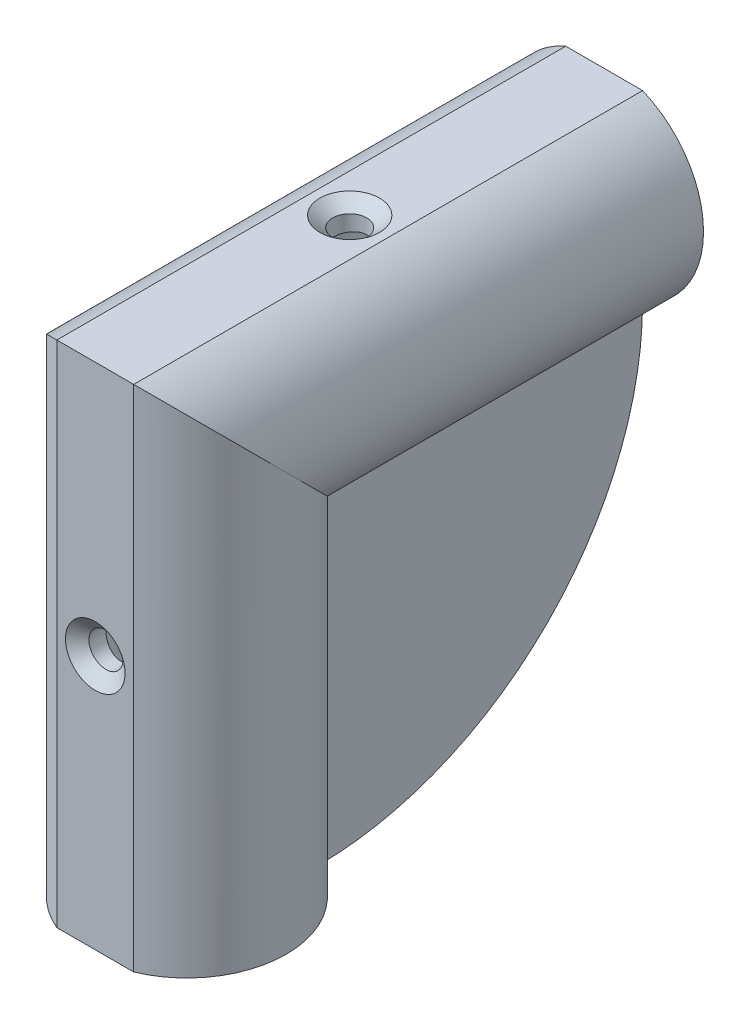
ISO-10303-21;
HEADER;
FILE_DESCRIPTION(('STEP AP214'),'2;1');
FILE_NAME('part.step','',(''),(''),'','','');
FILE_SCHEMA(('AUTOMOTIVE_DESIGN { 1 0 10303 214 1 1 1 1 }'));
ENDSEC;
DATA;
#1=APPLICATION_CONTEXT('core data for automotive mechanical design processes');
#2=APPLICATION_PROTOCOL_DEFINITION('international standard','automotive_design',2000,#1);
#3=PRODUCT_CONTEXT('',#1,'mechanical');
#4=PRODUCT('Part','Part','',(#3));
#5=PRODUCT_RELATED_PRODUCT_CATEGORY('part','',(#4));
#6=PRODUCT_DEFINITION_FORMATION('','',#4);
#7=PRODUCT_DEFINITION_CONTEXT('part definition',#1,'design');
#8=PRODUCT_DEFINITION('design','',#6,#7);
#9=PRODUCT_DEFINITION_SHAPE('','',#8);
#10=(LENGTH_UNIT() NAMED_UNIT(*) SI_UNIT(.MILLI.,.METRE.));
#11=(NAMED_UNIT(*) PLANE_ANGLE_UNIT() SI_UNIT($,.RADIAN.));
#12=(NAMED_UNIT(*) SI_UNIT($,.STERADIAN.) SOLID_ANGLE_UNIT());
#13=UNCERTAINTY_MEASURE_WITH_UNIT(LENGTH_MEASURE(1.E-05),#10,'distance_accuracy_value','');
#14=(GEOMETRIC_REPRESENTATION_CONTEXT(3) GLOBAL_UNCERTAINTY_ASSIGNED_CONTEXT((#13)) GLOBAL_UNIT_ASSIGNED_CONTEXT((#10,
#11,#12)) REPRESENTATION_CONTEXT('',''));
#15=CARTESIAN_POINT('',(0.,0.,0.));
#16=DIRECTION('',(0.,0.,1.));
#17=DIRECTION('',(1.,0.,0.));
#18=AXIS2_PLACEMENT_3D('',#15,#16,#17);
#19=CARTESIAN_POINT('',(-0.509990204288252,0.,0.));
#20=DIRECTION('',(1.,0.,0.));
#21=DIRECTION('',(0.,0.,-1.));
#22=AXIS2_PLACEMENT_3D('',#19,#20,#21);
#23=PLANE('',#22);
#24=CARTESIAN_POINT('',(-0.509990204288252,21.9038973614066,-27.511452395118));
#25=DIRECTION('',(1.,0.,0.));
#26=DIRECTION('',(0.,0.,-1.));
#27=AXIS2_PLACEMENT_3D('',#24,#25,#26);
#28=CIRCLE('',#27,1.63194999999999);
#29=CARTESIAN_POINT('',(-0.509990204288252,21.9038973614066,-29.143402395118));
#30=VERTEX_POINT('',#29);
#31=EDGE_CURVE('E229',#30,#30,#28,.T.);
#32=ORIENTED_EDGE('',*,*,#31,.F.);
#33=EDGE_LOOP('',(#32));
#34=FACE_BOUND('',#33,.T.);
#35=CARTESIAN_POINT('',(-0.509990204288252,12.488547604882,-18.0961026385934));
#36=DIRECTION('',(1.,0.,0.));
#37=DIRECTION('',(0.,0.,-1.));
#38=AXIS2_PLACEMENT_3D('',#35,#36,#37);
#39=CIRCLE('',#38,1.63194999999999);
#40=CARTESIAN_POINT('',(-0.509990204288252,12.488547604882,-19.7280526385934));
#41=VERTEX_POINT('',#40);
#42=EDGE_CURVE('E135',#41,#41,#39,.T.);
#43=ORIENTED_EDGE('',*,*,#42,.F.);
#44=EDGE_LOOP('',(#43));
#45=FACE_BOUND('',#44,.T.);
#46=DIRECTION('',(0.,0.,-1.));
#47=VECTOR('',#46,1.);
#48=CARTESIAN_POINT('',(-0.509990204288252,28.0165862273054,-11.9834137726946));
#49=LINE('',#48,#47);
#50=CARTESIAN_POINT('',(-0.509990204288252,28.0165862273054,-11.9834137726946));
#51=VERTEX_POINT('',#50);
#52=CARTESIAN_POINT('',(-0.509990204288252,28.0165862273054,-39.8355514718417));
#53=VERTEX_POINT('',#52);
#54=EDGE_CURVE('E51',#51,#53,#49,.T.);
#55=ORIENTED_EDGE('',*,*,#54,.F.);
#56=DIRECTION('',(0.,1.,0.));
#57=VECTOR('',#56,1.);
#58=CARTESIAN_POINT('',(-0.509990204288252,28.0165862273054,-11.9834137726946));
#59=LINE('',#58,#57);
#60=CARTESIAN_POINT('',(-0.509990204288252,0.164448528158289,-11.9834137726946));
#61=VERTEX_POINT('',#60);
#62=EDGE_CURVE('E138',#61,#51,#59,.T.);
#63=ORIENTED_EDGE('',*,*,#62,.F.);
#64=CARTESIAN_POINT('',(-0.509990204288252,31.2165862273054,-8.78341377269464));
#65=DIRECTION('',(1.,0.,0.));
#66=DIRECTION('',(0.,0.,-1.));
#67=AXIS2_PLACEMENT_3D('',#64,#65,#66);
#68=CIRCLE('',#67,31.2165862273054);
#69=EDGE_CURVE('E55',#61,#53,#68,.T.);
#70=ORIENTED_EDGE('',*,*,#69,.T.);
#71=EDGE_LOOP('',(#55,#63,#70));
#72=FACE_BOUND('',#71,.T.);
#73=ADVANCED_FACE('F34',(#34,#45,#72),#23,.T.);
#74=CARTESIAN_POINT('',(0.,40.,9.76175514996408));
#75=DIRECTION('',(0.,0.,-1.));
#76=DIRECTION('',(-1.,0.,0.));
#77=AXIS2_PLACEMENT_3D('',#74,#75,#76);
#78=CYLINDRICAL_SURFACE('',#77,9.52509896578834);
#79=CARTESIAN_POINT('',(0.,40.,0.));
#80=DIRECTION('',(0.,0.707106781186547,-0.707106781186547));
#81=DIRECTION('',(0.,0.707106781186548,0.707106781186548));
#82=AXIS2_PLACEMENT_3D('',#79,#80,#81);
#83=ELLIPSE('',#82,13.4705241403638,9.52509896578834);
#84=CARTESIAN_POINT('',(-3.68499020428826,48.7834137726946,8.78341377269463));
#85=VERTEX_POINT('',#84);
#86=CARTESIAN_POINT('',(-3.68499020428825,31.2165862273054,-8.78341377269464));
#87=VERTEX_POINT('',#86);
#88=EDGE_CURVE('E264',#85,#87,#83,.F.);
#89=ORIENTED_EDGE('',*,*,#88,.F.);
#90=DIRECTION('',(0.,0.,-1.));
#91=VECTOR('',#90,1.);
#92=CARTESIAN_POINT('',(-3.68499020428826,48.7834137726946,9.76175514996408));
#93=LINE('',#92,#91);
#94=CARTESIAN_POINT('',(-3.68499020428826,48.7834137726946,-40.));
#95=VERTEX_POINT('',#94);
#96=EDGE_CURVE('E256',#85,#95,#93,.T.);
#97=ORIENTED_EDGE('',*,*,#96,.T.);
#98=CARTESIAN_POINT('',(0.,40.,-40.));
#99=DIRECTION('',(0.,0.,-1.));
#100=DIRECTION('',(0.,1.,0.));
#101=AXIS2_PLACEMENT_3D('',#98,#99,#100);
#102=CIRCLE('',#101,9.52509896578834);
#103=CARTESIAN_POINT('',(-3.68499020428825,31.2165862273054,-40.));
#104=VERTEX_POINT('',#103);
#105=EDGE_CURVE('E277',#104,#95,#102,.T.);
#106=ORIENTED_EDGE('',*,*,#105,.F.);
#107=DIRECTION('',(0.,0.,-1.));
#108=VECTOR('',#107,1.);
#109=CARTESIAN_POINT('',(-3.68499020428825,31.2165862273054,9.76175514996408));
#110=LINE('',#109,#108);
#111=EDGE_CURVE('E38',#87,#104,#110,.T.);
#112=ORIENTED_EDGE('',*,*,#111,.F.);
#113=EDGE_LOOP('',(#89,#97,#106,#112));
#114=FACE_BOUND('',#113,.T.);
#115=ADVANCED_FACE('F189',(#114),#78,.T.);
#116=CARTESIAN_POINT('',(-3.68499020428826,48.7834137726946,9.76175514996408));
#117=DIRECTION('',(0.,1.,0.));
#118=DIRECTION('',(0.,0.,1.));
#119=AXIS2_PLACEMENT_3D('',#116,#117,#118);
#120=PLANE('',#119);
#121=CARTESIAN_POINT('',(-0.00012790899028611,48.7834137726946,-15.6082931136527));
#122=DIRECTION('',(0.,1.,0.));
#123=DIRECTION('',(0.,0.,1.));
#124=AXIS2_PLACEMENT_3D('',#121,#122,#123);
#125=CIRCLE('',#124,2.8575);
#126=CARTESIAN_POINT('',(-0.00012790899028611,48.7834137726946,-12.7507931136527));
#127=VERTEX_POINT('',#126);
#128=EDGE_CURVE('E166',#127,#127,#125,.T.);
#129=ORIENTED_EDGE('',*,*,#128,.F.);
#130=EDGE_LOOP('',(#129));
#131=FACE_BOUND('',#130,.T.);
#132=DIRECTION('',(-1.,0.,0.));
#133=VECTOR('',#132,1.);
#134=CARTESIAN_POINT('',(-3.68499020428826,48.7834137726946,8.78341377269463));
#135=LINE('',#134,#133);
#136=CARTESIAN_POINT('',(3.68473438630768,48.7834137726946,8.78341377269463));
#137=VERTEX_POINT('',#136);
#138=EDGE_CURVE('E287',#137,#85,#135,.T.);
#139=ORIENTED_EDGE('',*,*,#138,.F.);
#140=DIRECTION('',(0.,0.,-1.));
#141=VECTOR('',#140,1.);
#142=CARTESIAN_POINT('',(3.68473438630768,48.7834137726946,9.76175514996408));
#143=LINE('',#142,#141);
#144=CARTESIAN_POINT('',(3.68473438630768,48.7834137726946,-40.));
#145=VERTEX_POINT('',#144);
#146=EDGE_CURVE('E269',#137,#145,#143,.T.);
#147=ORIENTED_EDGE('',*,*,#146,.T.);
#148=DIRECTION('',(1.,0.,0.));
#149=VECTOR('',#148,1.);
#150=CARTESIAN_POINT('',(-3.68499020428826,48.7834137726946,-40.));
#151=LINE('',#150,#149);
#152=EDGE_CURVE('E284',#95,#145,#151,.T.);
#153=ORIENTED_EDGE('',*,*,#152,.F.);
#154=ORIENTED_EDGE('',*,*,#96,.F.);
#155=EDGE_LOOP('',(#139,#147,#153,#154));
#156=FACE_BOUND('',#155,.T.);
#157=ADVANCED_FACE('F338',(#131,#156),#120,.T.);
#158=CARTESIAN_POINT('',(0.,40.,9.76175514996408));
#159=DIRECTION('',(0.,0.,-1.));
#160=DIRECTION('',(-1.,0.,0.));
#161=AXIS2_PLACEMENT_3D('',#158,#159,#160);
#162=CYLINDRICAL_SURFACE('',#161,9.525);
#163=CARTESIAN_POINT('',(0.,40.,0.));
#164=DIRECTION('',(0.,0.707106781186547,-0.707106781186547));
#165=DIRECTION('',(0.,0.707106781186548,0.707106781186548));
#166=AXIS2_PLACEMENT_3D('',#163,#164,#165);
#167=ELLIPSE('',#166,13.4703841816037,9.525);
#168=CARTESIAN_POINT('',(3.68473438630768,31.2165862273054,-8.78341377269464));
#169=VERTEX_POINT('',#168);
#170=EDGE_CURVE('E266',#169,#137,#167,.F.);
#171=ORIENTED_EDGE('',*,*,#170,.F.);
#172=DIRECTION('',(0.,0.,-1.));
#173=VECTOR('',#172,1.);
#174=CARTESIAN_POINT('',(3.68473438630768,31.2165862273054,9.76175514996408));
#175=LINE('',#174,#173);
#176=CARTESIAN_POINT('',(3.68473438630768,31.2165862273054,-40.));
#177=VERTEX_POINT('',#176);
#178=EDGE_CURVE('E267',#169,#177,#175,.T.);
#179=ORIENTED_EDGE('',*,*,#178,.T.);
#180=CARTESIAN_POINT('',(0.,40.,-40.));
#181=DIRECTION('',(0.,0.,-1.));
#182=DIRECTION('',(0.,1.,0.));
#183=AXIS2_PLACEMENT_3D('',#180,#181,#182);
#184=CIRCLE('',#183,9.525);
#185=EDGE_CURVE('E289',#145,#177,#184,.T.);
#186=ORIENTED_EDGE('',*,*,#185,.F.);
#187=ORIENTED_EDGE('',*,*,#146,.F.);
#188=EDGE_LOOP('',(#171,#179,#186,#187));
#189=FACE_BOUND('',#188,.T.);
#190=ADVANCED_FACE('F36',(#189),#162,.T.);
#191=CARTESIAN_POINT('',(0.,0.,0.));
#192=DIRECTION('',(0.,1.,0.));
#193=DIRECTION('',(0.,0.,1.));
#194=AXIS2_PLACEMENT_3D('',#191,#192,#193);
#195=CYLINDRICAL_SURFACE('',#194,9.525);
#196=DIRECTION('',(0.,1.,0.));
#197=VECTOR('',#196,1.);
#198=CARTESIAN_POINT('',(3.68473438630768,0.,-8.78341377269463));
#199=LINE('',#198,#197);
#200=CARTESIAN_POINT('',(3.68473438630768,0.,-8.78341377269463));
#201=VERTEX_POINT('',#200);
#202=EDGE_CURVE('E261',#201,#169,#199,.T.);
#203=ORIENTED_EDGE('',*,*,#202,.T.);
#204=ORIENTED_EDGE('',*,*,#170,.T.);
#205=DIRECTION('',(0.,1.,0.));
#206=VECTOR('',#205,1.);
#207=CARTESIAN_POINT('',(3.68473438630768,0.,8.78341377269463));
#208=LINE('',#207,#206);
#209=CARTESIAN_POINT('',(3.68473438630768,0.,8.78341377269463));
#210=VERTEX_POINT('',#209);
#211=EDGE_CURVE('E254',#210,#137,#208,.T.);
#212=ORIENTED_EDGE('',*,*,#211,.F.);
#213=CARTESIAN_POINT('',(0.,0.,0.));
#214=DIRECTION('',(0.,1.,0.));
#215=DIRECTION('',(0.,0.,1.));
#216=AXIS2_PLACEMENT_3D('',#213,#214,#215);
#217=CIRCLE('',#216,9.525);
#218=EDGE_CURVE('E311',#210,#201,#217,.T.);
#219=ORIENTED_EDGE('',*,*,#218,.T.);
#220=EDGE_LOOP('',(#203,#204,#212,#219));
#221=FACE_BOUND('',#220,.T.);
#222=ADVANCED_FACE('F298',(#221),#195,.T.);
#223=CARTESIAN_POINT('',(-3.68499020428826,0.,8.78341377269463));
#224=DIRECTION('',(0.,0.,1.));
#225=DIRECTION('',(1.,0.,0.));
#226=AXIS2_PLACEMENT_3D('',#223,#224,#225);
#227=PLANE('',#226);
#228=CARTESIAN_POINT('',(-6.39544951406514E-05,24.3917068863473,8.78341377269463));
#229=DIRECTION('',(0.,0.,1.));
#230=DIRECTION('',(1.,0.,0.));
#231=AXIS2_PLACEMENT_3D('',#228,#229,#230);
#232=CIRCLE('',#231,2.8575);
#233=CARTESIAN_POINT('',(2.85743604550486,24.3917068863473,8.78341377269463));
#234=VERTEX_POINT('',#233);
#235=EDGE_CURVE('E151',#234,#234,#232,.T.);
#236=ORIENTED_EDGE('',*,*,#235,.F.);
#237=EDGE_LOOP('',(#236));
#238=FACE_BOUND('',#237,.T.);
#239=ORIENTED_EDGE('',*,*,#211,.T.);
#240=ORIENTED_EDGE('',*,*,#138,.T.);
#241=DIRECTION('',(0.,1.,0.));
#242=VECTOR('',#241,1.);
#243=CARTESIAN_POINT('',(-3.68499020428826,0.,8.78341377269463));
#244=LINE('',#243,#242);
#245=CARTESIAN_POINT('',(-3.68499020428826,0.,8.78341377269463));
#246=VERTEX_POINT('',#245);
#247=EDGE_CURVE('E251',#246,#85,#244,.T.);
#248=ORIENTED_EDGE('',*,*,#247,.F.);
#249=DIRECTION('',(1.,0.,0.));
#250=VECTOR('',#249,1.);
#251=CARTESIAN_POINT('',(-3.68499020428826,0.,8.78341377269463));
#252=LINE('',#251,#250);
#253=EDGE_CURVE('E308',#246,#210,#252,.T.);
#254=ORIENTED_EDGE('',*,*,#253,.T.);
#255=EDGE_LOOP('',(#239,#240,#248,#254));
#256=FACE_BOUND('',#255,.T.);
#257=ADVANCED_FACE('F305',(#238,#256),#227,.T.);
#258=CARTESIAN_POINT('',(0.,0.,0.));
#259=DIRECTION('',(0.,1.,0.));
#260=DIRECTION('',(0.,0.,1.));
#261=AXIS2_PLACEMENT_3D('',#258,#259,#260);
#262=CYLINDRICAL_SURFACE('',#261,9.52509896578834);
#263=ORIENTED_EDGE('',*,*,#247,.T.);
#264=ORIENTED_EDGE('',*,*,#88,.T.);
#265=DIRECTION('',(0.,1.,0.));
#266=VECTOR('',#265,1.);
#267=CARTESIAN_POINT('',(-3.68499020428825,0.,-8.78341377269463));
#268=LINE('',#267,#266);
#269=CARTESIAN_POINT('',(-3.68499020428825,0.,-8.78341377269463));
#270=VERTEX_POINT('',#269);
#271=EDGE_CURVE('E248',#270,#87,#268,.T.);
#272=ORIENTED_EDGE('',*,*,#271,.F.);
#273=CARTESIAN_POINT('',(0.,0.,0.));
#274=DIRECTION('',(0.,1.,0.));
#275=DIRECTION('',(0.,0.,1.));
#276=AXIS2_PLACEMENT_3D('',#273,#274,#275);
#277=CIRCLE('',#276,9.52509896578834);
#278=EDGE_CURVE('E294',#270,#246,#277,.T.);
#279=ORIENTED_EDGE('',*,*,#278,.T.);
#280=EDGE_LOOP('',(#263,#264,#272,#279));
#281=FACE_BOUND('',#280,.T.);
#282=ADVANCED_FACE('F322',(#281),#262,.T.);
#283=CARTESIAN_POINT('',(0.,40.,-40.));
#284=DIRECTION('',(0.,0.,-1.));
#285=DIRECTION('',(0.,1.,0.));
#286=AXIS2_PLACEMENT_3D('',#283,#284,#285);
#287=PLANE('',#286);
#288=CARTESIAN_POINT('',(0.,40.,-40.));
#289=DIRECTION('',(0.,0.,-1.));
#290=DIRECTION('',(0.,1.,0.));
#291=AXIS2_PLACEMENT_3D('',#288,#289,#290);
#292=CIRCLE('',#291,6.35);
#293=CARTESIAN_POINT('',(0.,46.35,-40.));
#294=VERTEX_POINT('',#293);
#295=EDGE_CURVE('E318',#294,#294,#292,.F.);
#296=ORIENTED_EDGE('',*,*,#295,.T.);
#297=EDGE_LOOP('',(#296));
#298=FACE_BOUND('',#297,.T.);
#299=ORIENTED_EDGE('',*,*,#105,.T.);
#300=ORIENTED_EDGE('',*,*,#152,.T.);
#301=ORIENTED_EDGE('',*,*,#185,.T.);
#302=DIRECTION('',(-1.,0.,0.));
#303=VECTOR('',#302,1.);
#304=CARTESIAN_POINT('',(-3.68499020428825,31.2165862273054,-40.));
#305=LINE('',#304,#303);
#306=EDGE_CURVE('E286',#177,#104,#305,.T.);
#307=ORIENTED_EDGE('',*,*,#306,.T.);
#308=EDGE_LOOP('',(#299,#300,#301,#307));
#309=FACE_BOUND('',#308,.T.);
#310=ADVANCED_FACE('F282',(#298,#309),#287,.T.);
#311=CARTESIAN_POINT('',(0.,0.,0.));
#312=DIRECTION('',(0.,1.,0.));
#313=DIRECTION('',(0.,0.,1.));
#314=AXIS2_PLACEMENT_3D('',#311,#312,#313);
#315=PLANE('',#314);
#316=CARTESIAN_POINT('',(0.,0.,0.));
#317=DIRECTION('',(0.,1.,0.));
#318=DIRECTION('',(0.,0.,1.));
#319=AXIS2_PLACEMENT_3D('',#316,#317,#318);
#320=CIRCLE('',#319,6.35);
#321=CARTESIAN_POINT('',(0.,0.,6.35));
#322=VERTEX_POINT('',#321);
#323=EDGE_CURVE('E43',#322,#322,#320,.F.);
#324=ORIENTED_EDGE('',*,*,#323,.F.);
#325=EDGE_LOOP('',(#324));
#326=FACE_BOUND('',#325,.T.);
#327=ORIENTED_EDGE('',*,*,#278,.F.);
#328=DIRECTION('',(-1.,0.,0.));
#329=VECTOR('',#328,1.);
#330=CARTESIAN_POINT('',(-3.68499020428825,0.,-8.78341377269463));
#331=LINE('',#330,#329);
#332=EDGE_CURVE('E313',#201,#270,#331,.T.);
#333=ORIENTED_EDGE('',*,*,#332,.F.);
#334=ORIENTED_EDGE('',*,*,#218,.F.);
#335=ORIENTED_EDGE('',*,*,#253,.F.);
#336=EDGE_LOOP('',(#327,#333,#334,#335));
#337=FACE_BOUND('',#336,.T.);
#338=ADVANCED_FACE('F321',(#326,#337),#315,.F.);
#339=CARTESIAN_POINT('',(0.,40.,7.08499999999999));
#340=DIRECTION('',(0.,0.,-1.));
#341=DIRECTION('',(-1.,0.,0.));
#342=AXIS2_PLACEMENT_3D('',#339,#340,#341);
#343=CYLINDRICAL_SURFACE('',#342,6.35);
#344=CARTESIAN_POINT('',(-0.00012790899028611,46.3499999987118,-13.9763431136527));
#345=CARTESIAN_POINT('',(-0.0902114292119154,46.349996721458,-13.9763454874293));
#346=CARTESIAN_POINT('',(-0.18032096494862,46.3480604276424,-13.9838270780855));
#347=CARTESIAN_POINT('',(-0.357951930781546,46.3405274490904,-14.0135075526206));
#348=CARTESIAN_POINT('',(-0.445471959614586,46.33492881909,-14.0357142578868));
#349=CARTESIAN_POINT('',(-0.615333574694803,46.3206901550401,-14.0940811567383));
#350=CARTESIAN_POINT('',(-0.697681424375359,46.3120538866147,-14.1302240795351));
#351=CARTESIAN_POINT('',(-0.85514577619398,46.2926566489912,-14.2153753292221));
#352=CARTESIAN_POINT('',(-0.930261934719397,46.2818955789075,-14.264384267027));
#353=CARTESIAN_POINT('',(-1.07275851435277,46.2591534707171,-14.3749980392741));
#354=CARTESIAN_POINT('',(-1.13995988349538,46.2471527620001,-14.4368294994317));
#355=CARTESIAN_POINT('',(-1.26316226088177,46.2234127409407,-14.5708482581104));
#356=CARTESIAN_POINT('',(-1.31916193326532,46.2116734599231,-14.6430367900052));
#357=CARTESIAN_POINT('',(-1.41922593086182,46.1895858643846,-14.797126597309));
#358=CARTESIAN_POINT('',(-1.46308765707335,46.1792624629684,-14.8791633350208));
#359=CARTESIAN_POINT('',(-1.53632692165545,46.1614632934655,-15.0497544803434));
#360=CARTESIAN_POINT('',(-1.56570692156002,46.1539870414832,-15.1383077773579));
#361=CARTESIAN_POINT('',(-1.60853329376497,46.1429312338897,-15.3174432995358));
#362=CARTESIAN_POINT('',(-1.62230277167076,46.1392727898181,-15.4079432948649));
#363=CARTESIAN_POINT('',(-1.63452404377718,46.1360308373311,-15.5900370096507));
#364=CARTESIAN_POINT('',(-1.63297848170916,46.1364466256084,-15.6816305376118));
#365=CARTESIAN_POINT('',(-1.61487078895094,46.1412353819414,-15.8608165928514));
#366=CARTESIAN_POINT('',(-1.59869606584953,46.1455062543702,-15.9484514275678));
#367=CARTESIAN_POINT('',(-1.55240821223609,46.157360966098,-16.1197199051297));
#368=CARTESIAN_POINT('',(-1.5222940385744,46.1649450533368,-16.2033532480093));
#369=CARTESIAN_POINT('',(-1.44865796635896,46.1826637913442,-16.365271544341));
#370=CARTESIAN_POINT('',(-1.40499744770294,46.1928246038255,-16.4434904737079));
#371=CARTESIAN_POINT('',(-1.3056049040958,46.214537520751,-16.5916294700144));
#372=CARTESIAN_POINT('',(-1.249870656803,46.2260898811553,-16.6615480054758));
#373=CARTESIAN_POINT('',(-1.12591665382357,46.2497122032276,-16.7933189201811));
#374=CARTESIAN_POINT('',(-1.05737061835912,46.261787259265,-16.854863866581));
#375=CARTESIAN_POINT('',(-0.910784544920367,46.2847806082454,-16.9656454350062));
#376=CARTESIAN_POINT('',(-0.832744183452787,46.29569886175,-17.0148816374699));
#377=CARTESIAN_POINT('',(-0.668930393418233,46.3152080642109,-17.0997703284368));
#378=CARTESIAN_POINT('',(-0.583128707115393,46.3237900120935,-17.135370489843));
#379=CARTESIAN_POINT('',(-0.406488231809591,46.3375945220048,-17.1915545910325));
#380=CARTESIAN_POINT('',(-0.315650466772263,46.3428177642444,-17.2121415714243));
#381=CARTESIAN_POINT('',(-0.134142557637654,46.3492148680703,-17.2372399968002));
#382=CARTESIAN_POINT('',(-0.0435338852759442,46.3504940775073,-17.2421697675732));
#383=CARTESIAN_POINT('',(0.137214554981928,46.3491604033243,-17.2369644128778));
#384=CARTESIAN_POINT('',(0.227354366839237,46.3465478914489,-17.2268307263004));
#385=CARTESIAN_POINT('',(0.403136060302095,46.337792199552,-17.1921302967434));
#386=CARTESIAN_POINT('',(0.48882648535033,46.3317054095355,-17.1677939349863));
#387=CARTESIAN_POINT('',(0.654902634697543,46.3166891013296,-17.1056438870245));
#388=CARTESIAN_POINT('',(0.735287805367051,46.3077592870212,-17.0678287968752));
#389=CARTESIAN_POINT('',(0.89011956720491,46.2877975944007,-16.9789986044251));
#390=CARTESIAN_POINT('',(0.964428621327627,46.2767298520392,-16.9277520303304));
#391=CARTESIAN_POINT('',(1.10354028219538,46.2537731154581,-16.813807407208));
#392=CARTESIAN_POINT('',(1.16834114648696,46.2418839712956,-16.7511072639347));
#393=CARTESIAN_POINT('',(1.28833694562738,46.2182418551092,-16.6140888288982));
#394=CARTESIAN_POINT('',(1.34323771212231,46.2065004960364,-16.539510458662));
#395=CARTESIAN_POINT('',(1.43974749480345,46.1848268477848,-16.3819548281141));
#396=CARTESIAN_POINT('',(1.48135709023395,46.1748944797764,-16.2989779340274));
#397=CARTESIAN_POINT('',(1.54979120368689,46.1580751530883,-16.1274151586759));
#398=CARTESIAN_POINT('',(1.57670284647563,46.151170297493,-16.0388658779358));
#399=CARTESIAN_POINT('',(1.61519787830356,46.1411756868181,-15.8582935038328));
#400=CARTESIAN_POINT('',(1.62678484855569,46.1380850404098,-15.7662712272439));
#401=CARTESIAN_POINT('',(1.6341065929289,46.1361394625449,-15.5843654582176));
#402=CARTESIAN_POINT('',(1.63031252886335,46.1371586314219,-15.4945019816681));
#403=CARTESIAN_POINT('',(1.60806426282458,46.1430252346684,-15.31674237805));
#404=CARTESIAN_POINT('',(1.58961038848685,46.147872583481,-15.2288462070588));
#405=CARTESIAN_POINT('',(1.53883033364093,46.1607771710635,-15.0580618556103));
#406=CARTESIAN_POINT('',(1.50659726486814,46.1688128393073,-14.9751442468168));
#407=CARTESIAN_POINT('',(1.4292467800089,46.1871905497154,-14.8158330557947));
#408=CARTESIAN_POINT('',(1.38412747820491,46.1975329293855,-14.7394404305319));
#409=CARTESIAN_POINT('',(1.28082847140765,46.2197136015963,-14.5930822835687));
#410=CARTESIAN_POINT('',(1.22232404713534,46.2315851822376,-14.5233509574043));
#411=CARTESIAN_POINT('',(1.09454202798398,46.2552931941316,-14.3945423057908));
#412=CARTESIAN_POINT('',(1.02526185531861,46.2671296162816,-14.3354675369374));
#413=CARTESIAN_POINT('',(0.876269895646557,46.2897083147262,-14.2285255544013));
#414=CARTESIAN_POINT('',(0.796381538545169,46.3004248554274,-14.1808984734443));
#415=CARTESIAN_POINT('',(0.629461931338849,46.3192807843939,-14.0998260327598));
#416=CARTESIAN_POINT('',(0.542435630323122,46.3274219395949,-14.0663709444609));
#417=CARTESIAN_POINT('',(0.379671821745912,46.3390679521026,-14.0193112640333));
#418=CARTESIAN_POINT('',(0.304680242550239,46.343139948709,-14.0032340848749));
#419=CARTESIAN_POINT('',(0.153089321538909,46.3486072527805,-13.981749450334));
#420=CARTESIAN_POINT('',(0.0764901159280041,46.3500027860886,-13.9763410947032));
#421=CARTESIAN_POINT('',(-0.00012790899028611,46.3499999987118,-13.9763431136527));
#422=B_SPLINE_CURVE_WITH_KNOTS('',3,(#344,#345,#346,#347,#348,#349,#350,#351,#352,#353,#354,
#355,#356,#357,#358,#359,#360,#361,#362,#363,#364,#365,#366,#367,#368,#369,#370,#371,#372,#373,
#374,#375,#376,#377,#378,#379,#380,#381,#382,#383,#384,#385,#386,#387,#388,#389,#390,#391,#392,
#393,#394,#395,#396,#397,#398,#399,#400,#401,#402,#403,#404,#405,#406,#407,#408,#409,#410,#411,
#412,#413,#414,#415,#416,#417,#418,#419,#420,#421),.UNSPECIFIED.,.T.,.F.,(4,2,2,2,2,2,2,2,2,2,2,
2,2,2,2,2,2,2,2,2,2,2,2,2,2,2,2,2,2,2,2,2,2,2,2,2,2,2,4),(0.,0.269969699865982,0.5400829117414,
0.809862449726125,1.07965479992257,1.35469904692408,1.62977607484434,1.90920013786364,
2.18857668933588,2.4620586554307,2.73549341301326,3.00189254819888,3.26831162241333,
3.53755227372039,3.80684252477461,4.08426679691828,4.36170052418646,4.64018846012879,
4.91861997843755,5.18954697691834,5.46044809758463,5.72707248483714,5.99372465180888,
6.26531471480868,6.53695448691076,6.81566963523564,7.09437263518102,7.37140512907668,
7.6483728719802,7.91692146717044,8.185464060675,8.45221999333121,8.71901498195549,
8.99313875502206,9.26732820542198,9.54684653215229,9.82617266727404,10.0558072413832,
10.2854224378212),.UNSPECIFIED.);
#423=CARTESIAN_POINT('',(-0.00012790899028611,46.3499999987118,-13.9763431136527));
#424=VERTEX_POINT('',#423);
#425=EDGE_CURVE('E270',#424,#424,#422,.T.);
#426=ORIENTED_EDGE('',*,*,#425,.F.);
#427=EDGE_LOOP('',(#426));
#428=FACE_BOUND('',#427,.T.);
#429=CARTESIAN_POINT('',(0.,40.,0.));
#430=DIRECTION('',(0.,0.707106781186548,-0.707106781186548));
#431=DIRECTION('',(0.,0.707106781186548,0.707106781186548));
#432=AXIS2_PLACEMENT_3D('',#429,#430,#431);
#433=ELLIPSE('',#432,8.98025612106916,6.35);
#434=CARTESIAN_POINT('',(0.,46.35,6.35000000000001));
#435=VERTEX_POINT('',#434);
#436=EDGE_CURVE('E11',#435,#435,#433,.T.);
#437=ORIENTED_EDGE('',*,*,#436,.F.);
#438=EDGE_LOOP('',(#437));
#439=FACE_BOUND('',#438,.T.);
#440=ORIENTED_EDGE('',*,*,#295,.F.);
#441=EDGE_LOOP('',(#440));
#442=FACE_BOUND('',#441,.T.);
#443=ADVANCED_FACE('F489',(#428,#439,#442),#343,.F.);
#444=CARTESIAN_POINT('',(0.,0.,0.));
#445=DIRECTION('',(0.,1.,0.));
#446=DIRECTION('',(0.,0.,1.));
#447=AXIS2_PLACEMENT_3D('',#444,#445,#446);
#448=CYLINDRICAL_SURFACE('',#447,6.35);
#449=CARTESIAN_POINT('',(0.,22.7597568876005,6.35));
#450=CARTESIAN_POINT('',(-0.0900831392395764,22.7597557309278,6.34999853740822));
#451=CARTESIAN_POINT('',(-0.180192623896491,22.7672337268315,6.34806407506398));
#452=CARTESIAN_POINT('',(-0.35782415488057,22.7969070251464,6.34053466402443));
#453=CARTESIAN_POINT('',(-0.445344800512656,22.8191101477833,6.33493777030478));
#454=CARTESIAN_POINT('',(-0.615208290642068,22.8774700279903,6.32070236130552));
#455=CARTESIAN_POINT('',(-0.697557396943561,22.9136095169562,6.31206761140134));
#456=CARTESIAN_POINT('',(-0.855024820500194,22.9987541289598,6.29267310228729));
#457=CARTESIAN_POINT('',(-0.930142794100134,23.0477598630459,6.28191324215694));
#458=CARTESIAN_POINT('',(-1.07264339916047,23.158367349364,6.25917321987912));
#459=CARTESIAN_POINT('',(-1.13984700652203,23.2201957099755,6.24717338172928));
#460=CARTESIAN_POINT('',(-1.26305437250148,23.3542085874051,6.22343466145042));
#461=CARTESIAN_POINT('',(-1.3190567950551,23.4263943378791,6.2116958105999));
#462=CARTESIAN_POINT('',(-1.41912706044526,23.5804793019839,6.18960856019666));
#463=CARTESIAN_POINT('',(-1.46299225067718,23.6625140252555,6.17928507385988));
#464=CARTESIAN_POINT('',(-1.53623876509789,23.8331017174061,6.16148529612144));
#465=CARTESIAN_POINT('',(-1.5656225500265,23.9216535759254,6.15400852104406));
#466=CARTESIAN_POINT('',(-1.60845677528559,24.1007874736912,6.14295128422327));
#467=CARTESIAN_POINT('',(-1.62223022278799,24.1912872929402,6.13929196445679));
#468=CARTESIAN_POINT('',(-1.63445933672878,24.3733813601635,6.13604807798014));
#469=CARTESIAN_POINT('',(-1.63291764716865,24.464975416502,6.1364628079269));
#470=CARTESIAN_POINT('',(-1.61481737492901,24.6441630888894,6.14124942153971));
#471=CARTESIAN_POINT('',(-1.59864622089059,24.7317989968861,6.14551920692675));
#472=CARTESIAN_POINT('',(-1.55236519612811,24.9030701939641,6.15737179745353));
#473=CARTESIAN_POINT('',(-1.52225428261016,24.9867051832315,6.16495485044704));
#474=CARTESIAN_POINT('',(-1.44862457763164,25.1486268197042,6.18267159330806));
#475=CARTESIAN_POINT('',(-1.40496723533024,25.2268474828617,6.1928314324465));
#476=CARTESIAN_POINT('',(-1.30558072280239,25.3749904340667,6.21454257524004));
#477=CARTESIAN_POINT('',(-1.24984933031461,25.4449111908222,6.22609413487106));
#478=CARTESIAN_POINT('',(-1.12590085434846,25.5766869262993,6.24971501938461));
#479=CARTESIAN_POINT('',(-1.05735749956989,25.638234503942,6.26178944464806));
#480=CARTESIAN_POINT('',(-0.91077636326422,25.7490217708331,6.28478176420233));
#481=CARTESIAN_POINT('',(-0.832738258029195,25.7982610402749,6.29569961903804));
#482=CARTESIAN_POINT('',(-0.668928242554798,25.8831563854432,6.31520826862751));
#483=CARTESIAN_POINT('',(-0.583128050183511,25.9187600938627,6.3237900559654));
#484=CARTESIAN_POINT('',(-0.40648995601346,25.9749515036703,6.33759439471464));
#485=CARTESIAN_POINT('',(-0.315653078245035,25.9955422454513,6.34281762626802));
#486=CARTESIAN_POINT('',(-0.134146097489857,26.0206482233996,6.34921478801351));
#487=CARTESIAN_POINT('',(-0.0435374792051107,26.0255817527243,6.35049405660184));
#488=CARTESIAN_POINT('',(0.137211474586347,26.0203838453105,6.34916047346206));
#489=CARTESIAN_POINT('',(0.227351854001213,26.010253847683,6.34654799353647));
#490=CARTESIAN_POINT('',(0.403135101786702,25.9755605949597,6.33779227002987));
#491=CARTESIAN_POINT('',(0.488826509726303,25.9512277491244,6.33170542426849));
#492=CARTESIAN_POINT('',(0.654905163466144,25.8890845280577,6.31668885572859));
#493=CARTESIAN_POINT('',(0.73529185574287,25.8512727489865,6.30775883684209));
#494=CARTESIAN_POINT('',(0.890127068426806,25.762449029008,6.28779655387536));
#495=CARTESIAN_POINT('',(0.964438072246056,25.7112056301759,6.27672842512942));
#496=CARTESIAN_POINT('',(1.10355412611651,25.5972670393755,6.25377069788672));
#497=CARTESIAN_POINT('',(1.16835743368791,25.5345697529635,6.24188094939721));
#498=CARTESIAN_POINT('',(1.2883587754268,25.3975565582164,6.21823736170391));
#499=CARTESIAN_POINT('',(1.34326262815844,25.3229805387935,6.20649513067377));
#500=CARTESIAN_POINT('',(1.43977895541293,25.165429065514,6.1848195513045));
#501=CARTESIAN_POINT('',(1.48139200875609,25.082453977648,6.17488612419925));
#502=CARTESIAN_POINT('',(1.54983340525508,24.9108939139258,6.15806455414054));
#503=CARTESIAN_POINT('',(1.57674882789848,24.8223455240716,6.15115852385783));
#504=CARTESIAN_POINT('',(1.61525148484127,24.6417742263367,6.14116160044415));
#505=CARTESIAN_POINT('',(1.6268423007362,24.5497521354862,6.13806981587678));
#506=CARTESIAN_POINT('',(1.63417153252487,24.3678462542541,6.13612217061798));
#507=CARTESIAN_POINT('',(1.63038114788556,24.2779825022802,6.13714039560522));
#508=CARTESIAN_POINT('',(1.60814011177057,24.1002217289999,6.14300537228737));
#509=CARTESIAN_POINT('',(1.58968978842433,24.0123246637189,6.1478520382913));
#510=CARTESIAN_POINT('',(1.53891672737552,23.8415384489433,6.16075557594905));
#511=CARTESIAN_POINT('',(1.50668717872629,23.7586198507841,6.16879085720309));
#512=CARTESIAN_POINT('',(1.42934358743022,23.59930612989,6.1871681644821));
#513=CARTESIAN_POINT('',(1.38422765911591,23.5229119640038,6.19751052805452));
#514=CARTESIAN_POINT('',(1.28093528908915,23.3765501813051,6.2196915756323));
#515=CARTESIAN_POINT('',(1.22243412482426,23.3068167436509,6.23156355874433));
#516=CARTESIAN_POINT('',(1.09465832986697,23.1780033292192,6.25527281211791));
#517=CARTESIAN_POINT('',(1.02538112094698,23.1189259092764,6.26711007337973));
#518=CARTESIAN_POINT('',(0.876394275624265,23.0119777087444,6.28969095903487));
#519=CARTESIAN_POINT('',(0.796508003187173,22.9643471296079,6.30040884756849));
#520=CARTESIAN_POINT('',(0.629591935283516,22.8832673734839,6.31926781238744));
#521=CARTESIAN_POINT('',(0.542567088910912,22.8498084689778,6.32741065522292));
#522=CARTESIAN_POINT('',(0.379804155070102,22.8027413251593,6.33906002837155));
#523=CARTESIAN_POINT('',(0.304812066731178,22.786660688532,6.34313362550723));
#524=CARTESIAN_POINT('',(0.15321958098955,22.7651694119085,6.3486041203654));
#525=CARTESIAN_POINT('',(0.0766193198748244,22.7597578713969,6.35000124399293));
#526=CARTESIAN_POINT('',(0.,22.7597568876005,6.35));
#527=B_SPLINE_CURVE_WITH_KNOTS('',3,(#449,#450,#451,#452,#453,#454,#455,#456,#457,#458,#459,
#460,#461,#462,#463,#464,#465,#466,#467,#468,#469,#470,#471,#472,#473,#474,#475,#476,#477,#478,
#479,#480,#481,#482,#483,#484,#485,#486,#487,#488,#489,#490,#491,#492,#493,#494,#495,#496,#497,
#498,#499,#500,#501,#502,#503,#504,#505,#506,#507,#508,#509,#510,#511,#512,#513,#514,#515,#516,
#517,#518,#519,#520,#521,#522,#523,#524,#525,#526),.UNSPECIFIED.,.T.,.F.,(4,2,2,2,2,2,2,2,2,2,2,
2,2,2,2,2,2,2,2,2,2,2,2,2,2,2,2,2,2,2,2,2,2,2,2,2,2,2,4),(0.,0.269968554282892,
0.540080598499884,0.809859015774317,1.07965024778144,1.35469282688249,1.62976819320285,
1.90919187389528,2.1885680573843,2.4620513892537,2.73548750784899,3.00188769250457,
3.26830780902375,3.53754802725807,3.80683784203951,4.08426117459366,4.36169396809224,
4.64018180437812,4.91861322624302,5.18954067220253,5.46044223646753,5.72706658687536,
5.99371871450128,6.2653083357141,6.53694766927035,6.81566296425564,7.09436611940836,
7.37139960555279,7.64836833327217,7.91691724320375,8.18546014244693,8.45221491882226,
8.71900874951279,8.99313127485942,9.26731948668462,9.54683828736357,9.82616491258054,
10.0558033698539,10.285422443871),.UNSPECIFIED.);
#528=CARTESIAN_POINT('',(0.,22.7597568876005,6.35));
#529=VERTEX_POINT('',#528);
#530=EDGE_CURVE('E159',#529,#529,#527,.T.);
#531=ORIENTED_EDGE('',*,*,#530,.F.);
#532=EDGE_LOOP('',(#531));
#533=FACE_BOUND('',#532,.T.);
#534=ORIENTED_EDGE('',*,*,#323,.T.);
#535=EDGE_LOOP('',(#534));
#536=FACE_BOUND('',#535,.T.);
#537=ORIENTED_EDGE('',*,*,#436,.T.);
#538=EDGE_LOOP('',(#537));
#539=FACE_BOUND('',#538,.T.);
#540=ADVANCED_FACE('F191',(#533,#536,#539),#448,.F.);
#541=CARTESIAN_POINT('',(-0.00012790899028611,48.7834137726946,-15.6082931136527));
#542=DIRECTION('',(0.,1.,0.));
#543=DIRECTION('',(0.,0.,1.));
#544=AXIS2_PLACEMENT_3D('',#541,#542,#543);
#545=CYLINDRICAL_SURFACE('',#544,1.63195);
#546=CARTESIAN_POINT('',(-0.00012790899028611,47.7550552197053,-15.6082931136527));
#547=DIRECTION('',(0.,1.,0.));
#548=DIRECTION('',(0.,0.,1.));
#549=AXIS2_PLACEMENT_3D('',#546,#547,#548);
#550=CIRCLE('',#549,1.63195);
#551=CARTESIAN_POINT('',(-0.00012790899028611,47.7550552197053,-13.9763431136527));
#552=VERTEX_POINT('',#551);
#553=EDGE_CURVE('E348',#552,#552,#550,.T.);
#554=ORIENTED_EDGE('',*,*,#553,.T.);
#555=EDGE_LOOP('',(#554));
#556=FACE_BOUND('',#555,.T.);
#557=ORIENTED_EDGE('',*,*,#425,.T.);
#558=EDGE_LOOP('',(#557));
#559=FACE_BOUND('',#558,.T.);
#560=ADVANCED_FACE('F339',(#556,#559),#545,.F.);
#561=CARTESIAN_POINT('',(-0.00012790899028611,48.7834137726946,-15.6082931136527));
#562=DIRECTION('',(0.,1.,0.));
#563=DIRECTION('',(0.,0.,1.));
#564=AXIS2_PLACEMENT_3D('',#561,#562,#563);
#565=CONICAL_SURFACE('',#564,2.8575,0.872664625997165);
#566=ORIENTED_EDGE('',*,*,#553,.F.);
#567=EDGE_LOOP('',(#566));
#568=FACE_BOUND('',#567,.T.);
#569=ORIENTED_EDGE('',*,*,#128,.T.);
#570=EDGE_LOOP('',(#569));
#571=FACE_BOUND('',#570,.T.);
#572=ADVANCED_FACE('F175',(#568,#571),#565,.F.);
#573=CARTESIAN_POINT('',(-6.39544951406514E-05,24.3917068863473,8.78341377269463));
#574=DIRECTION('',(0.,0.,1.));
#575=DIRECTION('',(1.,0.,0.));
#576=AXIS2_PLACEMENT_3D('',#573,#574,#575);
#577=CYLINDRICAL_SURFACE('',#576,1.63195);
#578=CARTESIAN_POINT('',(-6.39544951406514E-05,24.3917068863473,7.75505521970531));
#579=DIRECTION('',(0.,0.,1.));
#580=DIRECTION('',(1.,0.,0.));
#581=AXIS2_PLACEMENT_3D('',#578,#579,#580);
#582=CIRCLE('',#581,1.63195);
#583=CARTESIAN_POINT('',(1.63188604550486,24.3917068863473,7.75505521970531));
#584=VERTEX_POINT('',#583);
#585=EDGE_CURVE('E156',#584,#584,#582,.T.);
#586=ORIENTED_EDGE('',*,*,#585,.T.);
#587=EDGE_LOOP('',(#586));
#588=FACE_BOUND('',#587,.T.);
#589=ORIENTED_EDGE('',*,*,#530,.T.);
#590=EDGE_LOOP('',(#589));
#591=FACE_BOUND('',#590,.T.);
#592=ADVANCED_FACE('F170',(#588,#591),#577,.F.);
#593=CARTESIAN_POINT('',(-6.39544951406514E-05,24.3917068863473,8.78341377269463));
#594=DIRECTION('',(0.,0.,1.));
#595=DIRECTION('',(1.,0.,0.));
#596=AXIS2_PLACEMENT_3D('',#593,#594,#595);
#597=CONICAL_SURFACE('',#596,2.8575,0.872664625997164);
#598=ORIENTED_EDGE('',*,*,#585,.F.);
#599=EDGE_LOOP('',(#598));
#600=FACE_BOUND('',#599,.T.);
#601=ORIENTED_EDGE('',*,*,#235,.T.);
#602=EDGE_LOOP('',(#601));
#603=FACE_BOUND('',#602,.T.);
#604=ADVANCED_FACE('F174',(#600,#603),#597,.F.);
#605=CARTESIAN_POINT('',(-0.509990204288252,31.2165862273054,-8.78341377269464));
#606=DIRECTION('',(-1.,0.,0.));
#607=DIRECTION('',(0.,0.,1.));
#608=AXIS2_PLACEMENT_3D('',#605,#606,#607);
#609=CYLINDRICAL_SURFACE('',#608,31.2165862273054);
#610=CARTESIAN_POINT('',(-3.68499020428825,31.2165862273054,-8.78341377269464));
#611=DIRECTION('',(1.,0.,0.));
#612=DIRECTION('',(0.,0.,-1.));
#613=AXIS2_PLACEMENT_3D('',#610,#611,#612);
#614=CIRCLE('',#613,31.2165862273054);
#615=EDGE_CURVE('E131',#270,#104,#614,.T.);
#616=ORIENTED_EDGE('',*,*,#615,.T.);
#617=ORIENTED_EDGE('',*,*,#306,.F.);
#618=CARTESIAN_POINT('',(3.68473438630768,31.2165862273054,-8.78341377269464));
#619=DIRECTION('',(1.,0.,0.));
#620=DIRECTION('',(0.,0.,-1.));
#621=AXIS2_PLACEMENT_3D('',#618,#619,#620);
#622=CIRCLE('',#621,31.2165862273054);
#623=EDGE_CURVE('E134',#201,#177,#622,.T.);
#624=ORIENTED_EDGE('',*,*,#623,.F.);
#625=ORIENTED_EDGE('',*,*,#332,.T.);
#626=EDGE_LOOP('',(#616,#617,#624,#625));
#627=FACE_BOUND('',#626,.T.);
#628=CARTESIAN_POINT('',(2.66500979571175,31.2165862273054,-8.78341377269464));
#629=DIRECTION('',(1.,0.,0.));
#630=DIRECTION('',(0.,0.,-1.));
#631=AXIS2_PLACEMENT_3D('',#628,#629,#630);
#632=CIRCLE('',#631,31.2165862273054);
#633=CARTESIAN_POINT('',(2.66500979571175,0.164448528158289,-11.9834137726946));
#634=VERTEX_POINT('',#633);
#635=CARTESIAN_POINT('',(2.66500979571175,28.0165862273054,-39.8355514718417));
#636=VERTEX_POINT('',#635);
#637=EDGE_CURVE('E130',#634,#636,#632,.T.);
#638=ORIENTED_EDGE('',*,*,#637,.T.);
#639=DIRECTION('',(-1.,0.,0.));
#640=VECTOR('',#639,1.);
#641=CARTESIAN_POINT('',(2.66500979571175,28.0165862273054,-39.8355514718417));
#642=LINE('',#641,#640);
#643=EDGE_CURVE('E145',#636,#53,#642,.T.);
#644=ORIENTED_EDGE('',*,*,#643,.T.);
#645=ORIENTED_EDGE('',*,*,#69,.F.);
#646=DIRECTION('',(-1.,0.,0.));
#647=VECTOR('',#646,1.);
#648=CARTESIAN_POINT('',(2.66500979571175,0.164448528158287,-11.9834137726946));
#649=LINE('',#648,#647);
#650=EDGE_CURVE('E117',#634,#61,#649,.T.);
#651=ORIENTED_EDGE('',*,*,#650,.F.);
#652=EDGE_LOOP('',(#638,#644,#645,#651));
#653=FACE_BOUND('',#652,.T.);
#654=ADVANCED_FACE('F128',(#627,#653),#609,.T.);
#655=CARTESIAN_POINT('',(-3.68499020428825,0.,0.));
#656=DIRECTION('',(1.,0.,0.));
#657=DIRECTION('',(0.,0.,-1.));
#658=AXIS2_PLACEMENT_3D('',#655,#656,#657);
#659=PLANE('',#658);
#660=CARTESIAN_POINT('',(-3.68499020428825,21.9038973614066,-27.511452395118));
#661=DIRECTION('',(-1.,0.,0.));
#662=DIRECTION('',(0.,0.,1.));
#663=AXIS2_PLACEMENT_3D('',#660,#661,#662);
#664=CIRCLE('',#663,2.8575);
#665=CARTESIAN_POINT('',(-3.68499020428825,21.9038973614066,-24.653952395118));
#666=VERTEX_POINT('',#665);
#667=EDGE_CURVE('E227',#666,#666,#664,.T.);
#668=ORIENTED_EDGE('',*,*,#667,.F.);
#669=EDGE_LOOP('',(#668));
#670=FACE_BOUND('',#669,.T.);
#671=CARTESIAN_POINT('',(-3.68499020428825,12.488547604882,-18.0961026385934));
#672=DIRECTION('',(-1.,0.,0.));
#673=DIRECTION('',(0.,0.,1.));
#674=AXIS2_PLACEMENT_3D('',#671,#672,#673);
#675=CIRCLE('',#674,2.8575);
#676=CARTESIAN_POINT('',(-3.68499020428825,12.488547604882,-15.2386026385934));
#677=VERTEX_POINT('',#676);
#678=EDGE_CURVE('E234',#677,#677,#675,.T.);
#679=ORIENTED_EDGE('',*,*,#678,.F.);
#680=EDGE_LOOP('',(#679));
#681=FACE_BOUND('',#680,.T.);
#682=ORIENTED_EDGE('',*,*,#271,.T.);
#683=ORIENTED_EDGE('',*,*,#111,.T.);
#684=ORIENTED_EDGE('',*,*,#615,.F.);
#685=EDGE_LOOP('',(#682,#683,#684));
#686=FACE_BOUND('',#685,.T.);
#687=ADVANCED_FACE('F182',(#670,#681,#686),#659,.F.);
#688=CARTESIAN_POINT('',(2.66500979571175,28.0165862273054,-11.9834137726946));
#689=DIRECTION('',(0.,0.,1.));
#690=DIRECTION('',(1.,0.,0.));
#691=AXIS2_PLACEMENT_3D('',#688,#689,#690);
#692=PLANE('',#691);
#693=ORIENTED_EDGE('',*,*,#62,.T.);
#694=DIRECTION('',(-1.,0.,0.));
#695=VECTOR('',#694,1.);
#696=CARTESIAN_POINT('',(2.66500979571175,28.0165862273054,-11.9834137726946));
#697=LINE('',#696,#695);
#698=CARTESIAN_POINT('',(2.66500979571175,28.0165862273054,-11.9834137726946));
#699=VERTEX_POINT('',#698);
#700=EDGE_CURVE('E119',#699,#51,#697,.T.);
#701=ORIENTED_EDGE('',*,*,#700,.F.);
#702=DIRECTION('',(0.,1.,0.));
#703=VECTOR('',#702,1.);
#704=CARTESIAN_POINT('',(2.66500979571175,28.0165862273054,-11.9834137726946));
#705=LINE('',#704,#703);
#706=EDGE_CURVE('E114',#634,#699,#705,.T.);
#707=ORIENTED_EDGE('',*,*,#706,.F.);
#708=ORIENTED_EDGE('',*,*,#650,.T.);
#709=EDGE_LOOP('',(#693,#701,#707,#708));
#710=FACE_BOUND('',#709,.T.);
#711=ADVANCED_FACE('F116',(#710),#692,.F.);
#712=CARTESIAN_POINT('',(2.66500979571175,28.0165862273054,-11.9834137726946));
#713=DIRECTION('',(0.,1.,0.));
#714=DIRECTION('',(0.,0.,1.));
#715=AXIS2_PLACEMENT_3D('',#712,#713,#714);
#716=PLANE('',#715);
#717=ORIENTED_EDGE('',*,*,#54,.T.);
#718=ORIENTED_EDGE('',*,*,#643,.F.);
#719=DIRECTION('',(0.,0.,-1.));
#720=VECTOR('',#719,1.);
#721=CARTESIAN_POINT('',(2.66500979571175,28.0165862273054,-11.9834137726946));
#722=LINE('',#721,#720);
#723=EDGE_CURVE('E124',#699,#636,#722,.T.);
#724=ORIENTED_EDGE('',*,*,#723,.F.);
#725=ORIENTED_EDGE('',*,*,#700,.T.);
#726=EDGE_LOOP('',(#717,#718,#724,#725));
#727=FACE_BOUND('',#726,.T.);
#728=ADVANCED_FACE('F194',(#727),#716,.F.);
#729=CARTESIAN_POINT('',(2.66500979571175,31.2165862273054,-8.78341377269464));
#730=DIRECTION('',(1.,0.,0.));
#731=DIRECTION('',(0.,0.,-1.));
#732=AXIS2_PLACEMENT_3D('',#729,#730,#731);
#733=PLANE('',#732);
#734=ORIENTED_EDGE('',*,*,#637,.F.);
#735=ORIENTED_EDGE('',*,*,#706,.T.);
#736=ORIENTED_EDGE('',*,*,#723,.T.);
#737=EDGE_LOOP('',(#734,#735,#736));
#738=FACE_BOUND('',#737,.T.);
#739=ADVANCED_FACE('F133',(#738),#733,.F.);
#740=CARTESIAN_POINT('',(3.68473438630768,31.2165862273054,-8.78341377269464));
#741=DIRECTION('',(1.,0.,0.));
#742=DIRECTION('',(0.,0.,-1.));
#743=AXIS2_PLACEMENT_3D('',#740,#741,#742);
#744=PLANE('',#743);
#745=ORIENTED_EDGE('',*,*,#202,.F.);
#746=ORIENTED_EDGE('',*,*,#623,.T.);
#747=ORIENTED_EDGE('',*,*,#178,.F.);
#748=EDGE_LOOP('',(#745,#746,#747));
#749=FACE_BOUND('',#748,.T.);
#750=ADVANCED_FACE('F200',(#749),#744,.T.);
#751=CARTESIAN_POINT('',(-3.68499020428825,12.488547604882,-18.0961026385934));
#752=DIRECTION('',(-1.,0.,0.));
#753=DIRECTION('',(0.,0.,1.));
#754=AXIS2_PLACEMENT_3D('',#751,#752,#753);
#755=CYLINDRICAL_SURFACE('',#754,1.63194999999999);
#756=CARTESIAN_POINT('',(-2.65663165129892,12.488547604882,-18.0961026385934));
#757=DIRECTION('',(-1.,0.,0.));
#758=DIRECTION('',(0.,0.,1.));
#759=AXIS2_PLACEMENT_3D('',#756,#757,#758);
#760=CIRCLE('',#759,1.63194999999999);
#761=CARTESIAN_POINT('',(-2.65663165129892,12.488547604882,-16.4641526385934));
#762=VERTEX_POINT('',#761);
#763=EDGE_CURVE('E141',#762,#762,#760,.T.);
#764=ORIENTED_EDGE('',*,*,#763,.T.);
#765=EDGE_LOOP('',(#764));
#766=FACE_BOUND('',#765,.T.);
#767=ORIENTED_EDGE('',*,*,#42,.T.);
#768=EDGE_LOOP('',(#767));
#769=FACE_BOUND('',#768,.T.);
#770=ADVANCED_FACE('F203',(#766,#769),#755,.F.);
#771=CARTESIAN_POINT('',(-3.68499020428825,12.488547604882,-18.0961026385934));
#772=DIRECTION('',(-1.,0.,0.));
#773=DIRECTION('',(0.,0.,1.));
#774=AXIS2_PLACEMENT_3D('',#771,#772,#773);
#775=CONICAL_SURFACE('',#774,2.8575,0.872664625997162);
#776=ORIENTED_EDGE('',*,*,#763,.F.);
#777=EDGE_LOOP('',(#776));
#778=FACE_BOUND('',#777,.T.);
#779=ORIENTED_EDGE('',*,*,#678,.T.);
#780=EDGE_LOOP('',(#779));
#781=FACE_BOUND('',#780,.T.);
#782=ADVANCED_FACE('F207',(#778,#781),#775,.F.);
#783=CARTESIAN_POINT('',(-3.68499020428825,21.9038973614066,-27.511452395118));
#784=DIRECTION('',(-1.,0.,0.));
#785=DIRECTION('',(0.,0.,1.));
#786=AXIS2_PLACEMENT_3D('',#783,#784,#785);
#787=CYLINDRICAL_SURFACE('',#786,1.63194999999999);
#788=CARTESIAN_POINT('',(-2.65663165129892,21.9038973614066,-27.511452395118));
#789=DIRECTION('',(-1.,0.,0.));
#790=DIRECTION('',(0.,0.,1.));
#791=AXIS2_PLACEMENT_3D('',#788,#789,#790);
#792=CIRCLE('',#791,1.63194999999999);
#793=CARTESIAN_POINT('',(-2.65663165129892,21.9038973614066,-25.879502395118));
#794=VERTEX_POINT('',#793);
#795=EDGE_CURVE('E224',#794,#794,#792,.T.);
#796=ORIENTED_EDGE('',*,*,#795,.T.);
#797=EDGE_LOOP('',(#796));
#798=FACE_BOUND('',#797,.T.);
#799=ORIENTED_EDGE('',*,*,#31,.T.);
#800=EDGE_LOOP('',(#799));
#801=FACE_BOUND('',#800,.T.);
#802=ADVANCED_FACE('F211',(#798,#801),#787,.F.);
#803=CARTESIAN_POINT('',(-3.68499020428825,21.9038973614066,-27.511452395118));
#804=DIRECTION('',(-1.,0.,0.));
#805=DIRECTION('',(0.,0.,1.));
#806=AXIS2_PLACEMENT_3D('',#803,#804,#805);
#807=CONICAL_SURFACE('',#806,2.8575,0.872664625997163);
#808=ORIENTED_EDGE('',*,*,#795,.F.);
#809=EDGE_LOOP('',(#808));
#810=FACE_BOUND('',#809,.T.);
#811=ORIENTED_EDGE('',*,*,#667,.T.);
#812=EDGE_LOOP('',(#811));
#813=FACE_BOUND('',#812,.T.);
#814=ADVANCED_FACE('F215',(#810,#813),#807,.F.);
#815=CLOSED_SHELL('',(#73,#115,#157,#190,#222,#257,#282,#310,#338,#443,#540,#560,#572,#592,#604,
#654,#687,#711,#728,#739,#750,#770,#782,#802,#814));
#816=MANIFOLD_SOLID_BREP('B2',#815);
#817=ADVANCED_BREP_SHAPE_REPRESENTATION('',(#18,#816),#14);
#818=SHAPE_DEFINITION_REPRESENTATION(#9,#817);
ENDSEC;
END-ISO-10303-21;
